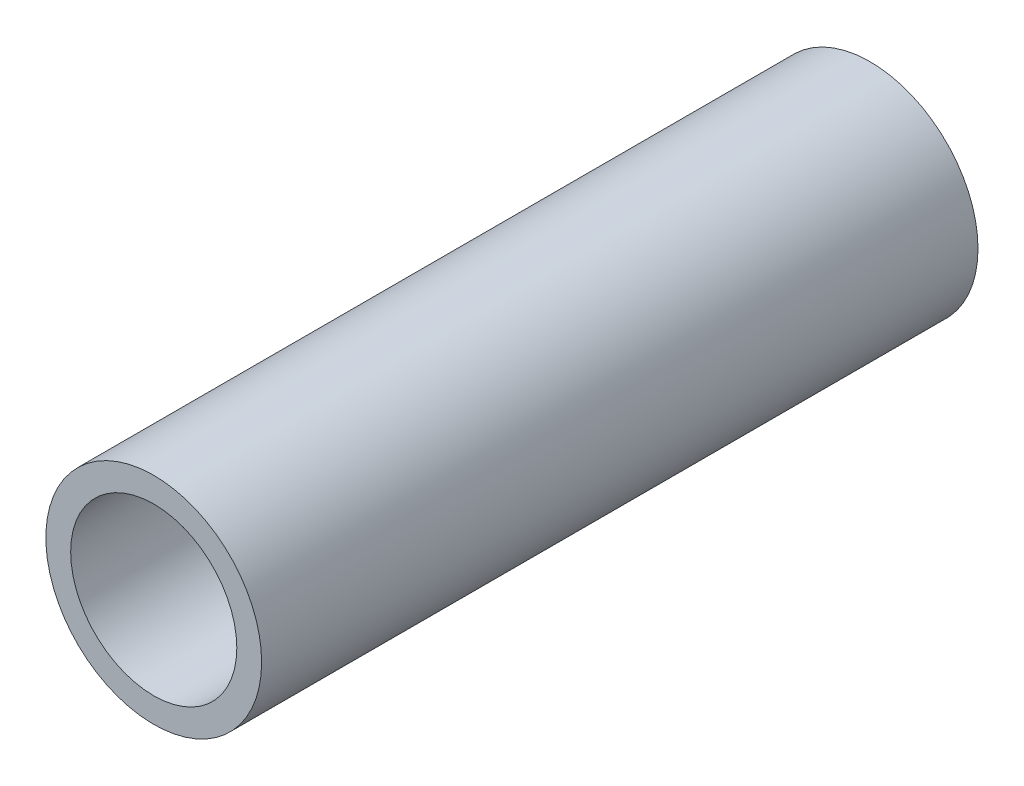
ISO-10303-21;
HEADER;
FILE_DESCRIPTION(('STEP AP214'),'2;1');
FILE_NAME('part.step','',(''),(''),'','','');
FILE_SCHEMA(('AUTOMOTIVE_DESIGN { 1 0 10303 214 1 1 1 1 }'));
ENDSEC;
DATA;
#1=APPLICATION_CONTEXT('core data for automotive mechanical design processes');
#2=APPLICATION_PROTOCOL_DEFINITION('international standard','automotive_design',2000,#1);
#3=PRODUCT_CONTEXT('',#1,'mechanical');
#4=PRODUCT('Part','Part','',(#3));
#5=PRODUCT_RELATED_PRODUCT_CATEGORY('part','',(#4));
#6=PRODUCT_DEFINITION_FORMATION('','',#4);
#7=PRODUCT_DEFINITION_CONTEXT('part definition',#1,'design');
#8=PRODUCT_DEFINITION('design','',#6,#7);
#9=PRODUCT_DEFINITION_SHAPE('','',#8);
#10=(LENGTH_UNIT() NAMED_UNIT(*) SI_UNIT(.MILLI.,.METRE.));
#11=(NAMED_UNIT(*) PLANE_ANGLE_UNIT() SI_UNIT($,.RADIAN.));
#12=(NAMED_UNIT(*) SI_UNIT($,.STERADIAN.) SOLID_ANGLE_UNIT());
#13=UNCERTAINTY_MEASURE_WITH_UNIT(LENGTH_MEASURE(1.E-05),#10,'distance_accuracy_value','');
#14=(GEOMETRIC_REPRESENTATION_CONTEXT(3) GLOBAL_UNCERTAINTY_ASSIGNED_CONTEXT((#13)) GLOBAL_UNIT_ASSIGNED_CONTEXT((#10,
#11,#12)) REPRESENTATION_CONTEXT('',''));
#15=CARTESIAN_POINT('',(0.,0.,0.));
#16=DIRECTION('',(0.,0.,1.));
#17=DIRECTION('',(1.,0.,0.));
#18=AXIS2_PLACEMENT_3D('',#15,#16,#17);
#19=CARTESIAN_POINT('',(0.,0.,42.164));
#20=DIRECTION('',(0.,0.,1.));
#21=DIRECTION('',(1.,0.,0.));
#22=AXIS2_PLACEMENT_3D('',#19,#20,#21);
#23=PLANE('',#22);
#24=CARTESIAN_POINT('',(0.,0.,42.164));
#25=DIRECTION('',(0.,0.,1.));
#26=DIRECTION('',(1.,0.,0.));
#27=AXIS2_PLACEMENT_3D('',#24,#25,#26);
#28=CIRCLE('',#27,6.35);
#29=CARTESIAN_POINT('',(6.35,0.,42.164));
#30=VERTEX_POINT('',#29);
#31=EDGE_CURVE('E10',#30,#30,#28,.T.);
#32=ORIENTED_EDGE('',*,*,#31,.T.);
#33=EDGE_LOOP('',(#32));
#34=FACE_BOUND('',#33,.T.);
#35=CARTESIAN_POINT('',(0.,0.,42.164));
#36=DIRECTION('',(0.,0.,1.));
#37=DIRECTION('',(1.,0.,0.));
#38=AXIS2_PLACEMENT_3D('',#35,#36,#37);
#39=CIRCLE('',#38,4.8895);
#40=CARTESIAN_POINT('',(4.8895,0.,42.164));
#41=VERTEX_POINT('',#40);
#42=EDGE_CURVE('E41',#41,#41,#39,.T.);
#43=ORIENTED_EDGE('',*,*,#42,.F.);
#44=EDGE_LOOP('',(#43));
#45=FACE_BOUND('',#44,.T.);
#46=ADVANCED_FACE('F30',(#34,#45),#23,.T.);
#47=CARTESIAN_POINT('',(0.,0.,0.));
#48=DIRECTION('',(0.,0.,1.));
#49=DIRECTION('',(1.,0.,0.));
#50=AXIS2_PLACEMENT_3D('',#47,#48,#49);
#51=PLANE('',#50);
#52=CARTESIAN_POINT('',(0.,0.,0.));
#53=DIRECTION('',(0.,0.,1.));
#54=DIRECTION('',(1.,0.,0.));
#55=AXIS2_PLACEMENT_3D('',#52,#53,#54);
#56=CIRCLE('',#55,6.35);
#57=CARTESIAN_POINT('',(6.35,0.,0.));
#58=VERTEX_POINT('',#57);
#59=EDGE_CURVE('E34',#58,#58,#56,.T.);
#60=ORIENTED_EDGE('',*,*,#59,.F.);
#61=EDGE_LOOP('',(#60));
#62=FACE_BOUND('',#61,.T.);
#63=CARTESIAN_POINT('',(0.,0.,0.));
#64=DIRECTION('',(0.,0.,1.));
#65=DIRECTION('',(1.,0.,0.));
#66=AXIS2_PLACEMENT_3D('',#63,#64,#65);
#67=CIRCLE('',#66,4.8895);
#68=CARTESIAN_POINT('',(4.8895,0.,0.));
#69=VERTEX_POINT('',#68);
#70=EDGE_CURVE('E43',#69,#69,#67,.T.);
#71=ORIENTED_EDGE('',*,*,#70,.T.);
#72=EDGE_LOOP('',(#71));
#73=FACE_BOUND('',#72,.T.);
#74=ADVANCED_FACE('F53',(#62,#73),#51,.F.);
#75=CARTESIAN_POINT('',(0.,0.,42.164));
#76=DIRECTION('',(0.,0.,-1.));
#77=DIRECTION('',(-1.,0.,0.));
#78=AXIS2_PLACEMENT_3D('',#75,#76,#77);
#79=CYLINDRICAL_SURFACE('',#78,6.35);
#80=ORIENTED_EDGE('',*,*,#31,.F.);
#81=EDGE_LOOP('',(#80));
#82=FACE_BOUND('',#81,.T.);
#83=ORIENTED_EDGE('',*,*,#59,.T.);
#84=EDGE_LOOP('',(#83));
#85=FACE_BOUND('',#84,.T.);
#86=ADVANCED_FACE('F32',(#82,#85),#79,.T.);
#87=CARTESIAN_POINT('',(0.,0.,42.164));
#88=DIRECTION('',(0.,0.,-1.));
#89=DIRECTION('',(-1.,0.,0.));
#90=AXIS2_PLACEMENT_3D('',#87,#88,#89);
#91=CYLINDRICAL_SURFACE('',#90,4.8895);
#92=ORIENTED_EDGE('',*,*,#42,.T.);
#93=EDGE_LOOP('',(#92));
#94=FACE_BOUND('',#93,.T.);
#95=ORIENTED_EDGE('',*,*,#70,.F.);
#96=EDGE_LOOP('',(#95));
#97=FACE_BOUND('',#96,.T.);
#98=ADVANCED_FACE('F49',(#94,#97),#91,.F.);
#99=CLOSED_SHELL('',(#46,#74,#86,#98));
#100=MANIFOLD_SOLID_BREP('B2',#99);
#101=ADVANCED_BREP_SHAPE_REPRESENTATION('',(#18,#100),#14);
#102=SHAPE_DEFINITION_REPRESENTATION(#9,#101);
ENDSEC;
END-ISO-10303-21;
